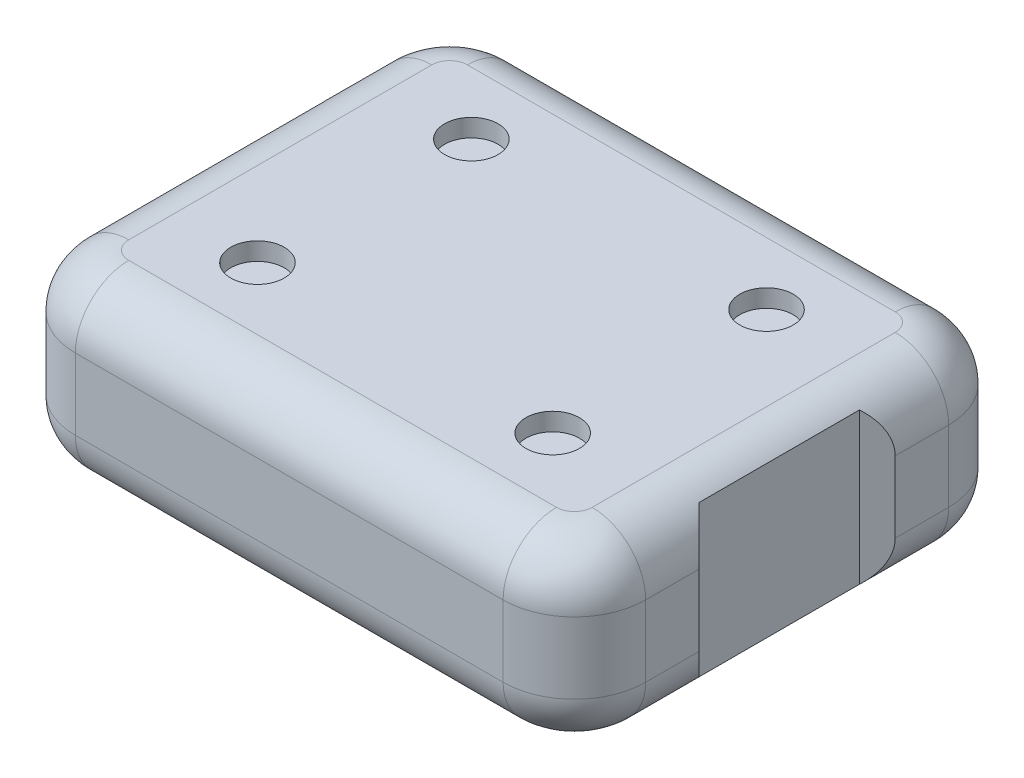
ISO-10303-21;
HEADER;
FILE_DESCRIPTION(('STEP AP214'),'2;1');
FILE_NAME('part.step','',(''),(''),'','','');
FILE_SCHEMA(('AUTOMOTIVE_DESIGN { 1 0 10303 214 1 1 1 1 }'));
ENDSEC;
DATA;
#1=APPLICATION_CONTEXT('core data for automotive mechanical design processes');
#2=APPLICATION_PROTOCOL_DEFINITION('international standard','automotive_design',2000,#1);
#3=PRODUCT_CONTEXT('',#1,'mechanical');
#4=PRODUCT('Part','Part','',(#3));
#5=PRODUCT_RELATED_PRODUCT_CATEGORY('part','',(#4));
#6=PRODUCT_DEFINITION_FORMATION('','',#4);
#7=PRODUCT_DEFINITION_CONTEXT('part definition',#1,'design');
#8=PRODUCT_DEFINITION('design','',#6,#7);
#9=PRODUCT_DEFINITION_SHAPE('','',#8);
#10=(LENGTH_UNIT() NAMED_UNIT(*) SI_UNIT(.MILLI.,.METRE.));
#11=(NAMED_UNIT(*) PLANE_ANGLE_UNIT() SI_UNIT($,.RADIAN.));
#12=(NAMED_UNIT(*) SI_UNIT($,.STERADIAN.) SOLID_ANGLE_UNIT());
#13=UNCERTAINTY_MEASURE_WITH_UNIT(LENGTH_MEASURE(1.E-05),#10,'distance_accuracy_value','');
#14=(GEOMETRIC_REPRESENTATION_CONTEXT(3) GLOBAL_UNCERTAINTY_ASSIGNED_CONTEXT((#13)) GLOBAL_UNIT_ASSIGNED_CONTEXT((#10,
#11,#12)) REPRESENTATION_CONTEXT('',''));
#15=CARTESIAN_POINT('',(0.,0.,0.));
#16=DIRECTION('',(0.,0.,1.));
#17=DIRECTION('',(1.,0.,0.));
#18=AXIS2_PLACEMENT_3D('',#15,#16,#17);
#19=CARTESIAN_POINT('',(1.2,1.,-0.85));
#20=DIRECTION('',(0.,-1.,0.));
#21=DIRECTION('',(0.,0.,-1.));
#22=AXIS2_PLACEMENT_3D('',#19,#20,#21);
#23=CYLINDRICAL_SURFACE('',#22,0.4);
#24=DIRECTION('',(0.,-1.,0.));
#25=VECTOR('',#24,1.);
#26=CARTESIAN_POINT('',(1.6,1.,-0.849999999999997));
#27=LINE('',#26,#25);
#28=CARTESIAN_POINT('',(1.6,0.7,-0.849999999999997));
#29=VERTEX_POINT('',#28);
#30=CARTESIAN_POINT('',(1.6,0.3,-0.849999999999997));
#31=VERTEX_POINT('',#30);
#32=EDGE_CURVE('E195',#29,#31,#27,.T.);
#33=ORIENTED_EDGE('',*,*,#32,.T.);
#34=CARTESIAN_POINT('',(1.2,0.3,-0.85));
#35=DIRECTION('',(0.,-1.,0.));
#36=DIRECTION('',(0.,0.,-1.));
#37=AXIS2_PLACEMENT_3D('',#34,#35,#36);
#38=CIRCLE('',#37,0.4);
#39=CARTESIAN_POINT('',(1.2,0.3,-1.25));
#40=VERTEX_POINT('',#39);
#41=EDGE_CURVE('E202',#31,#40,#38,.F.);
#42=ORIENTED_EDGE('',*,*,#41,.T.);
#43=DIRECTION('',(0.,-1.,0.));
#44=VECTOR('',#43,1.);
#45=CARTESIAN_POINT('',(1.2,1.,-1.25));
#46=LINE('',#45,#44);
#47=CARTESIAN_POINT('',(1.2,0.7,-1.25));
#48=VERTEX_POINT('',#47);
#49=EDGE_CURVE('E197',#48,#40,#46,.T.);
#50=ORIENTED_EDGE('',*,*,#49,.F.);
#51=CARTESIAN_POINT('',(1.2,0.7,-0.85));
#52=DIRECTION('',(0.,-1.,0.));
#53=DIRECTION('',(0.,0.,-1.));
#54=AXIS2_PLACEMENT_3D('',#51,#52,#53);
#55=CIRCLE('',#54,0.4);
#56=EDGE_CURVE('E193',#48,#29,#55,.T.);
#57=ORIENTED_EDGE('',*,*,#56,.T.);
#58=EDGE_LOOP('',(#33,#42,#50,#57));
#59=FACE_BOUND('',#58,.T.);
#60=ADVANCED_FACE('F31',(#59),#23,.T.);
#61=CARTESIAN_POINT('',(-1.2,1.,-1.25));
#62=DIRECTION('',(0.,0.,1.));
#63=DIRECTION('',(1.,0.,0.));
#64=AXIS2_PLACEMENT_3D('',#61,#62,#63);
#65=PLANE('',#64);
#66=DIRECTION('',(0.,-1.,0.));
#67=VECTOR('',#66,1.);
#68=CARTESIAN_POINT('',(-1.2,1.,-1.25));
#69=LINE('',#68,#67);
#70=CARTESIAN_POINT('',(-1.2,0.7,-1.25));
#71=VERTEX_POINT('',#70);
#72=CARTESIAN_POINT('',(-1.2,0.3,-1.25));
#73=VERTEX_POINT('',#72);
#74=EDGE_CURVE('E359',#71,#73,#69,.T.);
#75=ORIENTED_EDGE('',*,*,#74,.F.);
#76=DIRECTION('',(-1.,0.,0.));
#77=VECTOR('',#76,1.);
#78=CARTESIAN_POINT('',(-1.2,0.7,-1.25));
#79=LINE('',#78,#77);
#80=EDGE_CURVE('E11',#71,#48,#79,.F.);
#81=ORIENTED_EDGE('',*,*,#80,.T.);
#82=ORIENTED_EDGE('',*,*,#49,.T.);
#83=DIRECTION('',(-1.,0.,0.));
#84=VECTOR('',#83,1.);
#85=CARTESIAN_POINT('',(-1.2,0.3,-1.25));
#86=LINE('',#85,#84);
#87=EDGE_CURVE('E40',#40,#73,#86,.T.);
#88=ORIENTED_EDGE('',*,*,#87,.T.);
#89=EDGE_LOOP('',(#75,#81,#82,#88));
#90=FACE_BOUND('',#89,.T.);
#91=ADVANCED_FACE('F500',(#90),#65,.F.);
#92=CARTESIAN_POINT('',(-1.2,1.,-0.85));
#93=DIRECTION('',(0.,-1.,0.));
#94=DIRECTION('',(0.,0.,-1.));
#95=AXIS2_PLACEMENT_3D('',#92,#93,#94);
#96=CYLINDRICAL_SURFACE('',#95,0.4);
#97=ORIENTED_EDGE('',*,*,#74,.T.);
#98=CARTESIAN_POINT('',(-1.2,0.3,-0.85));
#99=DIRECTION('',(0.,-1.,0.));
#100=DIRECTION('',(0.,0.,-1.));
#101=AXIS2_PLACEMENT_3D('',#98,#99,#100);
#102=CIRCLE('',#101,0.4);
#103=CARTESIAN_POINT('',(-1.6,0.3,-0.849999999999997));
#104=VERTEX_POINT('',#103);
#105=EDGE_CURVE('E316',#73,#104,#102,.F.);
#106=ORIENTED_EDGE('',*,*,#105,.T.);
#107=DIRECTION('',(0.,-1.,0.));
#108=VECTOR('',#107,1.);
#109=CARTESIAN_POINT('',(-1.6,1.,-0.849999999999997));
#110=LINE('',#109,#108);
#111=CARTESIAN_POINT('',(-1.6,0.7,-0.849999999999997));
#112=VERTEX_POINT('',#111);
#113=EDGE_CURVE('E362',#112,#104,#110,.T.);
#114=ORIENTED_EDGE('',*,*,#113,.F.);
#115=CARTESIAN_POINT('',(-1.2,0.7,-0.85));
#116=DIRECTION('',(0.,-1.,0.));
#117=DIRECTION('',(0.,0.,-1.));
#118=AXIS2_PLACEMENT_3D('',#115,#116,#117);
#119=CIRCLE('',#118,0.4);
#120=EDGE_CURVE('E318',#112,#71,#119,.T.);
#121=ORIENTED_EDGE('',*,*,#120,.T.);
#122=EDGE_LOOP('',(#97,#106,#114,#121));
#123=FACE_BOUND('',#122,.T.);
#124=ADVANCED_FACE('F505',(#123),#96,.T.);
#125=CARTESIAN_POINT('',(-1.6,1.,-0.55));
#126=DIRECTION('',(1.,0.,0.));
#127=DIRECTION('',(0.,0.,-1.));
#128=AXIS2_PLACEMENT_3D('',#125,#126,#127);
#129=PLANE('',#128);
#130=ORIENTED_EDGE('',*,*,#113,.T.);
#131=DIRECTION('',(0.,0.,1.));
#132=VECTOR('',#131,1.);
#133=CARTESIAN_POINT('',(-1.6,0.3,-0.55));
#134=LINE('',#133,#132);
#135=CARTESIAN_POINT('',(-1.6,0.3,-0.55));
#136=VERTEX_POINT('',#135);
#137=EDGE_CURVE('E329',#104,#136,#134,.T.);
#138=ORIENTED_EDGE('',*,*,#137,.T.);
#139=DIRECTION('',(0.,-1.,0.));
#140=VECTOR('',#139,1.);
#141=CARTESIAN_POINT('',(-1.6,1.,-0.55));
#142=LINE('',#141,#140);
#143=CARTESIAN_POINT('',(-1.6,0.7,-0.55));
#144=VERTEX_POINT('',#143);
#145=EDGE_CURVE('E365',#144,#136,#142,.T.);
#146=ORIENTED_EDGE('',*,*,#145,.F.);
#147=DIRECTION('',(0.,0.,1.));
#148=VECTOR('',#147,1.);
#149=CARTESIAN_POINT('',(-1.6,0.7,-0.55));
#150=LINE('',#149,#148);
#151=EDGE_CURVE('E331',#144,#112,#150,.F.);
#152=ORIENTED_EDGE('',*,*,#151,.T.);
#153=EDGE_LOOP('',(#130,#138,#146,#152));
#154=FACE_BOUND('',#153,.T.);
#155=ADVANCED_FACE('F702',(#154),#129,.F.);
#156=CARTESIAN_POINT('',(-1.5,1.,-0.45));
#157=DIRECTION('',(0.707106781186547,0.,-0.707106781186548));
#158=DIRECTION('',(-0.707106781186548,0.,-0.707106781186547));
#159=AXIS2_PLACEMENT_3D('',#156,#157,#158);
#160=PLANE('',#159);
#161=ORIENTED_EDGE('',*,*,#145,.T.);
#162=CARTESIAN_POINT('',(-1.3,0.3,-0.250000000000001));
#163=DIRECTION('',(0.707106781186547,0.,-0.707106781186548));
#164=DIRECTION('',(-0.707106781186548,0.,-0.707106781186547));
#165=AXIS2_PLACEMENT_3D('',#162,#163,#164);
#166=ELLIPSE('',#165,0.424264068711928,0.3);
#167=CARTESIAN_POINT('',(-1.5,0.0763932022500207,-0.45));
#168=VERTEX_POINT('',#167);
#169=EDGE_CURVE('E324',#136,#168,#166,.F.);
#170=ORIENTED_EDGE('',*,*,#169,.T.);
#171=DIRECTION('',(0.,-1.,0.));
#172=VECTOR('',#171,1.);
#173=CARTESIAN_POINT('',(-1.5,1.,-0.45));
#174=LINE('',#173,#172);
#175=CARTESIAN_POINT('',(-1.5,0.923606797749979,-0.45));
#176=VERTEX_POINT('',#175);
#177=EDGE_CURVE('E368',#176,#168,#174,.T.);
#178=ORIENTED_EDGE('',*,*,#177,.F.);
#179=CARTESIAN_POINT('',(-1.3,0.7,-0.25));
#180=DIRECTION('',(0.707106781186547,0.,-0.707106781186548));
#181=DIRECTION('',(0.707106781186548,0.,0.707106781186547));
#182=AXIS2_PLACEMENT_3D('',#179,#180,#181);
#183=ELLIPSE('',#182,0.424264068711928,0.3);
#184=EDGE_CURVE('E327',#176,#144,#183,.F.);
#185=ORIENTED_EDGE('',*,*,#184,.T.);
#186=EDGE_LOOP('',(#161,#170,#178,#185));
#187=FACE_BOUND('',#186,.T.);
#188=ADVANCED_FACE('F692',(#187),#160,.F.);
#189=CARTESIAN_POINT('',(-1.5,1.,-0.45));
#190=DIRECTION('',(1.,0.,0.));
#191=DIRECTION('',(0.,0.,-1.));
#192=AXIS2_PLACEMENT_3D('',#189,#190,#191);
#193=PLANE('',#192);
#194=ORIENTED_EDGE('',*,*,#177,.T.);
#195=DIRECTION('',(0.,0.,-1.));
#196=VECTOR('',#195,1.);
#197=CARTESIAN_POINT('',(-1.5,0.0763932022500209,-0.45));
#198=LINE('',#197,#196);
#199=CARTESIAN_POINT('',(-1.5,0.0763932022500209,0.45));
#200=VERTEX_POINT('',#199);
#201=EDGE_CURVE('E320',#168,#200,#198,.F.);
#202=ORIENTED_EDGE('',*,*,#201,.T.);
#203=DIRECTION('',(0.,-1.,0.));
#204=VECTOR('',#203,1.);
#205=CARTESIAN_POINT('',(-1.5,1.,0.45));
#206=LINE('',#205,#204);
#207=CARTESIAN_POINT('',(-1.5,0.92360679774998,0.45));
#208=VERTEX_POINT('',#207);
#209=EDGE_CURVE('E371',#208,#200,#206,.T.);
#210=ORIENTED_EDGE('',*,*,#209,.F.);
#211=DIRECTION('',(0.,0.,1.));
#212=VECTOR('',#211,1.);
#213=CARTESIAN_POINT('',(-1.5,0.92360679774998,0.45));
#214=LINE('',#213,#212);
#215=EDGE_CURVE('E322',#208,#176,#214,.F.);
#216=ORIENTED_EDGE('',*,*,#215,.T.);
#217=EDGE_LOOP('',(#194,#202,#210,#216));
#218=FACE_BOUND('',#217,.T.);
#219=ADVANCED_FACE('F682',(#218),#193,.F.);
#220=CARTESIAN_POINT('',(-1.5,1.,0.45));
#221=DIRECTION('',(0.707106781186547,0.,0.707106781186548));
#222=DIRECTION('',(0.707106781186548,0.,-0.707106781186547));
#223=AXIS2_PLACEMENT_3D('',#220,#221,#222);
#224=PLANE('',#223);
#225=ORIENTED_EDGE('',*,*,#209,.T.);
#226=CARTESIAN_POINT('',(-1.3,0.3,0.250000000000001));
#227=DIRECTION('',(0.707106781186547,0.,0.707106781186548));
#228=DIRECTION('',(0.707106781186548,0.,-0.707106781186547));
#229=AXIS2_PLACEMENT_3D('',#226,#227,#228);
#230=ELLIPSE('',#229,0.424264068711928,0.3);
#231=CARTESIAN_POINT('',(-1.6,0.3,0.55));
#232=VERTEX_POINT('',#231);
#233=EDGE_CURVE('E306',#200,#232,#230,.F.);
#234=ORIENTED_EDGE('',*,*,#233,.T.);
#235=DIRECTION('',(0.,-1.,0.));
#236=VECTOR('',#235,1.);
#237=CARTESIAN_POINT('',(-1.6,1.,0.55));
#238=LINE('',#237,#236);
#239=CARTESIAN_POINT('',(-1.6,0.7,0.55));
#240=VERTEX_POINT('',#239);
#241=EDGE_CURVE('E374',#240,#232,#238,.T.);
#242=ORIENTED_EDGE('',*,*,#241,.F.);
#243=CARTESIAN_POINT('',(-1.3,0.7,0.250000000000001));
#244=DIRECTION('',(0.707106781186547,0.,0.707106781186548));
#245=DIRECTION('',(-0.707106781186548,0.,0.707106781186547));
#246=AXIS2_PLACEMENT_3D('',#243,#244,#245);
#247=ELLIPSE('',#246,0.424264068711928,0.3);
#248=EDGE_CURVE('E308',#240,#208,#247,.F.);
#249=ORIENTED_EDGE('',*,*,#248,.T.);
#250=EDGE_LOOP('',(#225,#234,#242,#249));
#251=FACE_BOUND('',#250,.T.);
#252=ADVANCED_FACE('F672',(#251),#224,.F.);
#253=CARTESIAN_POINT('',(-1.6,1.,0.849999999999997));
#254=DIRECTION('',(1.,0.,0.));
#255=DIRECTION('',(0.,0.,-1.));
#256=AXIS2_PLACEMENT_3D('',#253,#254,#255);
#257=PLANE('',#256);
#258=ORIENTED_EDGE('',*,*,#241,.T.);
#259=DIRECTION('',(0.,0.,1.));
#260=VECTOR('',#259,1.);
#261=CARTESIAN_POINT('',(-1.6,0.3,0.849999999999997));
#262=LINE('',#261,#260);
#263=CARTESIAN_POINT('',(-1.6,0.3,0.849999999999997));
#264=VERTEX_POINT('',#263);
#265=EDGE_CURVE('E311',#232,#264,#262,.T.);
#266=ORIENTED_EDGE('',*,*,#265,.T.);
#267=DIRECTION('',(0.,-1.,0.));
#268=VECTOR('',#267,1.);
#269=CARTESIAN_POINT('',(-1.6,1.,0.849999999999997));
#270=LINE('',#269,#268);
#271=CARTESIAN_POINT('',(-1.6,0.7,0.849999999999997));
#272=VERTEX_POINT('',#271);
#273=EDGE_CURVE('E377',#272,#264,#270,.T.);
#274=ORIENTED_EDGE('',*,*,#273,.F.);
#275=DIRECTION('',(0.,0.,1.));
#276=VECTOR('',#275,1.);
#277=CARTESIAN_POINT('',(-1.6,0.7,0.849999999999997));
#278=LINE('',#277,#276);
#279=EDGE_CURVE('E313',#272,#240,#278,.F.);
#280=ORIENTED_EDGE('',*,*,#279,.T.);
#281=EDGE_LOOP('',(#258,#266,#274,#280));
#282=FACE_BOUND('',#281,.T.);
#283=ADVANCED_FACE('F662',(#282),#257,.F.);
#284=CARTESIAN_POINT('',(-1.2,1.,0.85));
#285=DIRECTION('',(0.,-1.,0.));
#286=DIRECTION('',(0.,0.,-1.));
#287=AXIS2_PLACEMENT_3D('',#284,#285,#286);
#288=CYLINDRICAL_SURFACE('',#287,0.4);
#289=ORIENTED_EDGE('',*,*,#273,.T.);
#290=CARTESIAN_POINT('',(-1.2,0.3,0.85));
#291=DIRECTION('',(0.,-1.,0.));
#292=DIRECTION('',(0.,0.,-1.));
#293=AXIS2_PLACEMENT_3D('',#290,#291,#292);
#294=CIRCLE('',#293,0.4);
#295=CARTESIAN_POINT('',(-1.2,0.3,1.25));
#296=VERTEX_POINT('',#295);
#297=EDGE_CURVE('E302',#264,#296,#294,.F.);
#298=ORIENTED_EDGE('',*,*,#297,.T.);
#299=DIRECTION('',(0.,-1.,0.));
#300=VECTOR('',#299,1.);
#301=CARTESIAN_POINT('',(-1.2,1.,1.25));
#302=LINE('',#301,#300);
#303=CARTESIAN_POINT('',(-1.2,0.7,1.25));
#304=VERTEX_POINT('',#303);
#305=EDGE_CURVE('E380',#304,#296,#302,.T.);
#306=ORIENTED_EDGE('',*,*,#305,.F.);
#307=CARTESIAN_POINT('',(-1.2,0.7,0.85));
#308=DIRECTION('',(0.,-1.,0.));
#309=DIRECTION('',(0.,0.,-1.));
#310=AXIS2_PLACEMENT_3D('',#307,#308,#309);
#311=CIRCLE('',#310,0.4);
#312=EDGE_CURVE('E304',#304,#272,#311,.T.);
#313=ORIENTED_EDGE('',*,*,#312,.T.);
#314=EDGE_LOOP('',(#289,#298,#306,#313));
#315=FACE_BOUND('',#314,.T.);
#316=ADVANCED_FACE('F652',(#315),#288,.T.);
#317=CARTESIAN_POINT('',(-1.2,1.,1.25));
#318=DIRECTION('',(0.,0.,-1.));
#319=DIRECTION('',(-1.,0.,0.));
#320=AXIS2_PLACEMENT_3D('',#317,#318,#319);
#321=PLANE('',#320);
#322=DIRECTION('',(0.,-1.,0.));
#323=VECTOR('',#322,1.);
#324=CARTESIAN_POINT('',(1.2,1.,1.25));
#325=LINE('',#324,#323);
#326=CARTESIAN_POINT('',(1.2,0.7,1.25));
#327=VERTEX_POINT('',#326);
#328=CARTESIAN_POINT('',(1.2,0.3,1.25));
#329=VERTEX_POINT('',#328);
#330=EDGE_CURVE('E383',#327,#329,#325,.T.);
#331=ORIENTED_EDGE('',*,*,#330,.F.);
#332=DIRECTION('',(1.,0.,0.));
#333=VECTOR('',#332,1.);
#334=CARTESIAN_POINT('',(-1.2,0.7,1.25));
#335=LINE('',#334,#333);
#336=EDGE_CURVE('E273',#327,#304,#335,.F.);
#337=ORIENTED_EDGE('',*,*,#336,.T.);
#338=ORIENTED_EDGE('',*,*,#305,.T.);
#339=DIRECTION('',(1.,0.,0.));
#340=VECTOR('',#339,1.);
#341=CARTESIAN_POINT('',(1.2,0.3,1.25));
#342=LINE('',#341,#340);
#343=EDGE_CURVE('E275',#296,#329,#342,.T.);
#344=ORIENTED_EDGE('',*,*,#343,.T.);
#345=EDGE_LOOP('',(#331,#337,#338,#344));
#346=FACE_BOUND('',#345,.T.);
#347=ADVANCED_FACE('F643',(#346),#321,.F.);
#348=CARTESIAN_POINT('',(1.2,1.,0.85));
#349=DIRECTION('',(0.,-1.,0.));
#350=DIRECTION('',(0.,0.,-1.));
#351=AXIS2_PLACEMENT_3D('',#348,#349,#350);
#352=CYLINDRICAL_SURFACE('',#351,0.4);
#353=ORIENTED_EDGE('',*,*,#330,.T.);
#354=CARTESIAN_POINT('',(1.2,0.3,0.85));
#355=DIRECTION('',(0.,-1.,0.));
#356=DIRECTION('',(0.,0.,-1.));
#357=AXIS2_PLACEMENT_3D('',#354,#355,#356);
#358=CIRCLE('',#357,0.4);
#359=CARTESIAN_POINT('',(1.6,0.3,0.849999999999997));
#360=VERTEX_POINT('',#359);
#361=EDGE_CURVE('E290',#329,#360,#358,.F.);
#362=ORIENTED_EDGE('',*,*,#361,.T.);
#363=DIRECTION('',(0.,-1.,0.));
#364=VECTOR('',#363,1.);
#365=CARTESIAN_POINT('',(1.6,1.,0.849999999999997));
#366=LINE('',#365,#364);
#367=CARTESIAN_POINT('',(1.6,0.7,0.849999999999997));
#368=VERTEX_POINT('',#367);
#369=EDGE_CURVE('E386',#368,#360,#366,.T.);
#370=ORIENTED_EDGE('',*,*,#369,.F.);
#371=CARTESIAN_POINT('',(1.2,0.7,0.85));
#372=DIRECTION('',(0.,-1.,0.));
#373=DIRECTION('',(0.,0.,-1.));
#374=AXIS2_PLACEMENT_3D('',#371,#372,#373);
#375=CIRCLE('',#374,0.4);
#376=EDGE_CURVE('E292',#368,#327,#375,.T.);
#377=ORIENTED_EDGE('',*,*,#376,.T.);
#378=EDGE_LOOP('',(#353,#362,#370,#377));
#379=FACE_BOUND('',#378,.T.);
#380=ADVANCED_FACE('F470',(#379),#352,.T.);
#381=CARTESIAN_POINT('',(1.6,1.,0.849999999999997));
#382=DIRECTION('',(-1.,0.,0.));
#383=DIRECTION('',(0.,0.,1.));
#384=AXIS2_PLACEMENT_3D('',#381,#382,#383);
#385=PLANE('',#384);
#386=ORIENTED_EDGE('',*,*,#369,.T.);
#387=DIRECTION('',(0.,0.,-1.));
#388=VECTOR('',#387,1.);
#389=CARTESIAN_POINT('',(1.6,0.3,0.55));
#390=LINE('',#389,#388);
#391=CARTESIAN_POINT('',(1.6,0.3,0.55));
#392=VERTEX_POINT('',#391);
#393=EDGE_CURVE('E298',#360,#392,#390,.T.);
#394=ORIENTED_EDGE('',*,*,#393,.T.);
#395=DIRECTION('',(0.,-1.,0.));
#396=VECTOR('',#395,1.);
#397=CARTESIAN_POINT('',(1.6,1.,0.55));
#398=LINE('',#397,#396);
#399=CARTESIAN_POINT('',(1.6,0.7,0.55));
#400=VERTEX_POINT('',#399);
#401=EDGE_CURVE('E389',#400,#392,#398,.T.);
#402=ORIENTED_EDGE('',*,*,#401,.F.);
#403=DIRECTION('',(0.,0.,-1.));
#404=VECTOR('',#403,1.);
#405=CARTESIAN_POINT('',(1.6,0.7,0.849999999999997));
#406=LINE('',#405,#404);
#407=EDGE_CURVE('E300',#400,#368,#406,.F.);
#408=ORIENTED_EDGE('',*,*,#407,.T.);
#409=EDGE_LOOP('',(#386,#394,#402,#408));
#410=FACE_BOUND('',#409,.T.);
#411=ADVANCED_FACE('F467',(#410),#385,.F.);
#412=CARTESIAN_POINT('',(1.5,1.,0.45));
#413=DIRECTION('',(-0.707106781186544,0.,0.707106781186551));
#414=DIRECTION('',(0.707106781186551,0.,0.707106781186544));
#415=AXIS2_PLACEMENT_3D('',#412,#413,#414);
#416=PLANE('',#415);
#417=ORIENTED_EDGE('',*,*,#401,.T.);
#418=CARTESIAN_POINT('',(1.3,0.3,0.250000000000003));
#419=DIRECTION('',(-0.707106781186544,0.,0.707106781186551));
#420=DIRECTION('',(0.707106781186551,0.,0.707106781186544));
#421=AXIS2_PLACEMENT_3D('',#418,#419,#420);
#422=ELLIPSE('',#421,0.424264068711926,0.3);
#423=CARTESIAN_POINT('',(1.5,0.0763932022500202,0.45));
#424=VERTEX_POINT('',#423);
#425=EDGE_CURVE('E294',#392,#424,#422,.F.);
#426=ORIENTED_EDGE('',*,*,#425,.T.);
#427=DIRECTION('',(0.,-1.,0.));
#428=VECTOR('',#427,1.);
#429=CARTESIAN_POINT('',(1.5,1.,0.45));
#430=LINE('',#429,#428);
#431=CARTESIAN_POINT('',(1.5,0.92360679774998,0.45));
#432=VERTEX_POINT('',#431);
#433=EDGE_CURVE('E392',#432,#424,#430,.T.);
#434=ORIENTED_EDGE('',*,*,#433,.F.);
#435=CARTESIAN_POINT('',(1.3,0.7,0.250000000000003));
#436=DIRECTION('',(-0.707106781186544,0.,0.707106781186551));
#437=DIRECTION('',(-0.707106781186551,0.,-0.707106781186544));
#438=AXIS2_PLACEMENT_3D('',#435,#436,#437);
#439=ELLIPSE('',#438,0.424264068711926,0.3);
#440=EDGE_CURVE('E296',#432,#400,#439,.F.);
#441=ORIENTED_EDGE('',*,*,#440,.T.);
#442=EDGE_LOOP('',(#417,#426,#434,#441));
#443=FACE_BOUND('',#442,.T.);
#444=ADVANCED_FACE('F483',(#443),#416,.F.);
#445=CARTESIAN_POINT('',(1.5,1.,-0.45));
#446=DIRECTION('',(-1.,0.,0.));
#447=DIRECTION('',(0.,0.,1.));
#448=AXIS2_PLACEMENT_3D('',#445,#446,#447);
#449=PLANE('',#448);
#450=DIRECTION('',(0.,0.,1.));
#451=VECTOR('',#450,1.);
#452=CARTESIAN_POINT('',(1.5,0.0763932022500203,0.45));
#453=LINE('',#452,#451);
#454=CARTESIAN_POINT('',(1.5,0.0763932022500203,-0.45));
#455=VERTEX_POINT('',#454);
#456=EDGE_CURVE('E336',#424,#455,#453,.F.);
#457=ORIENTED_EDGE('',*,*,#456,.T.);
#458=DIRECTION('',(0.,-1.,0.));
#459=VECTOR('',#458,1.);
#460=CARTESIAN_POINT('',(1.5,1.,-0.45));
#461=LINE('',#460,#459);
#462=CARTESIAN_POINT('',(1.5,0.92360679774998,-0.45));
#463=VERTEX_POINT('',#462);
#464=EDGE_CURVE('E395',#463,#455,#461,.T.);
#465=ORIENTED_EDGE('',*,*,#464,.F.);
#466=DIRECTION('',(0.,0.,-1.));
#467=VECTOR('',#466,1.);
#468=CARTESIAN_POINT('',(1.5,0.92360679774998,-0.45));
#469=LINE('',#468,#467);
#470=EDGE_CURVE('E338',#463,#432,#469,.F.);
#471=ORIENTED_EDGE('',*,*,#470,.T.);
#472=ORIENTED_EDGE('',*,*,#433,.T.);
#473=EDGE_LOOP('',(#457,#465,#471,#472));
#474=FACE_BOUND('',#473,.T.);
#475=ADVANCED_FACE('F486',(#474),#449,.F.);
#476=CARTESIAN_POINT('',(1.5,1.,-0.45));
#477=DIRECTION('',(-0.707106781186544,0.,-0.707106781186551));
#478=DIRECTION('',(-0.707106781186551,0.,0.707106781186544));
#479=AXIS2_PLACEMENT_3D('',#476,#477,#478);
#480=PLANE('',#479);
#481=ORIENTED_EDGE('',*,*,#464,.T.);
#482=CARTESIAN_POINT('',(1.3,0.3,-0.250000000000002));
#483=DIRECTION('',(-0.707106781186544,0.,-0.707106781186551));
#484=DIRECTION('',(-0.707106781186551,0.,0.707106781186544));
#485=AXIS2_PLACEMENT_3D('',#482,#483,#484);
#486=ELLIPSE('',#485,0.424264068711927,0.3);
#487=CARTESIAN_POINT('',(1.6,0.3,-0.55));
#488=VERTEX_POINT('',#487);
#489=EDGE_CURVE('E203',#455,#488,#486,.F.);
#490=ORIENTED_EDGE('',*,*,#489,.T.);
#491=DIRECTION('',(0.,-1.,0.));
#492=VECTOR('',#491,1.);
#493=CARTESIAN_POINT('',(1.6,1.,-0.55));
#494=LINE('',#493,#492);
#495=CARTESIAN_POINT('',(1.6,0.7,-0.55));
#496=VERTEX_POINT('',#495);
#497=EDGE_CURVE('E214',#496,#488,#494,.T.);
#498=ORIENTED_EDGE('',*,*,#497,.F.);
#499=CARTESIAN_POINT('',(1.3,0.7,-0.250000000000002));
#500=DIRECTION('',(-0.707106781186544,0.,-0.707106781186551));
#501=DIRECTION('',(0.707106781186551,0.,-0.707106781186544));
#502=AXIS2_PLACEMENT_3D('',#499,#500,#501);
#503=ELLIPSE('',#502,0.424264068711927,0.3);
#504=EDGE_CURVE('E222',#496,#463,#503,.F.);
#505=ORIENTED_EDGE('',*,*,#504,.T.);
#506=EDGE_LOOP('',(#481,#490,#498,#505));
#507=FACE_BOUND('',#506,.T.);
#508=ADVANCED_FACE('F490',(#507),#480,.F.);
#509=CARTESIAN_POINT('',(1.6,1.,-0.55));
#510=DIRECTION('',(-1.,0.,0.));
#511=DIRECTION('',(0.,0.,1.));
#512=AXIS2_PLACEMENT_3D('',#509,#510,#511);
#513=PLANE('',#512);
#514=ORIENTED_EDGE('',*,*,#497,.T.);
#515=DIRECTION('',(0.,0.,-1.));
#516=VECTOR('',#515,1.);
#517=CARTESIAN_POINT('',(1.6,0.3,-0.849999999999997));
#518=LINE('',#517,#516);
#519=EDGE_CURVE('E213',#488,#31,#518,.T.);
#520=ORIENTED_EDGE('',*,*,#519,.T.);
#521=ORIENTED_EDGE('',*,*,#32,.F.);
#522=DIRECTION('',(0.,0.,-1.));
#523=VECTOR('',#522,1.);
#524=CARTESIAN_POINT('',(1.6,0.7,-0.55));
#525=LINE('',#524,#523);
#526=EDGE_CURVE('E210',#29,#496,#525,.F.);
#527=ORIENTED_EDGE('',*,*,#526,.T.);
#528=EDGE_LOOP('',(#514,#520,#521,#527));
#529=FACE_BOUND('',#528,.T.);
#530=ADVANCED_FACE('F209',(#529),#513,.F.);
#531=CARTESIAN_POINT('',(1.2,1.,-0.85));
#532=DIRECTION('',(0.,-1.,0.));
#533=DIRECTION('',(0.,0.,-1.));
#534=AXIS2_PLACEMENT_3D('',#531,#532,#533);
#535=PLANE('',#534);
#536=CARTESIAN_POINT('',(0.828084679575029,1.,0.6));
#537=DIRECTION('',(0.,1.,0.));
#538=DIRECTION('',(0.,0.,1.));
#539=AXIS2_PLACEMENT_3D('',#536,#537,#538);
#540=CIRCLE('',#539,0.15);
#541=CARTESIAN_POINT('',(0.828084679575029,1.,0.75));
#542=VERTEX_POINT('',#541);
#543=EDGE_CURVE('E417',#542,#542,#540,.T.);
#544=ORIENTED_EDGE('',*,*,#543,.F.);
#545=EDGE_LOOP('',(#544));
#546=FACE_BOUND('',#545,.T.);
#547=CARTESIAN_POINT('',(-0.828084679575029,1.,0.6));
#548=DIRECTION('',(0.,1.,0.));
#549=DIRECTION('',(0.,0.,1.));
#550=AXIS2_PLACEMENT_3D('',#547,#548,#549);
#551=CIRCLE('',#550,0.15);
#552=CARTESIAN_POINT('',(-0.828084679575029,1.,0.75));
#553=VERTEX_POINT('',#552);
#554=EDGE_CURVE('E411',#553,#553,#551,.T.);
#555=ORIENTED_EDGE('',*,*,#554,.F.);
#556=EDGE_LOOP('',(#555));
#557=FACE_BOUND('',#556,.T.);
#558=CARTESIAN_POINT('',(-0.828084679575029,1.,-0.6));
#559=DIRECTION('',(0.,1.,0.));
#560=DIRECTION('',(0.,0.,1.));
#561=AXIS2_PLACEMENT_3D('',#558,#559,#560);
#562=CIRCLE('',#561,0.15);
#563=CARTESIAN_POINT('',(-0.828084679575029,1.,-0.45));
#564=VERTEX_POINT('',#563);
#565=EDGE_CURVE('E405',#564,#564,#562,.T.);
#566=ORIENTED_EDGE('',*,*,#565,.F.);
#567=EDGE_LOOP('',(#566));
#568=FACE_BOUND('',#567,.T.);
#569=CARTESIAN_POINT('',(0.828084679575029,1.,-0.6));
#570=DIRECTION('',(0.,1.,0.));
#571=DIRECTION('',(0.,0.,1.));
#572=AXIS2_PLACEMENT_3D('',#569,#570,#571);
#573=CIRCLE('',#572,0.15);
#574=CARTESIAN_POINT('',(0.828084679575029,1.,-0.45));
#575=VERTEX_POINT('',#574);
#576=EDGE_CURVE('E399',#575,#575,#573,.T.);
#577=ORIENTED_EDGE('',*,*,#576,.F.);
#578=EDGE_LOOP('',(#577));
#579=FACE_BOUND('',#578,.T.);
#580=DIRECTION('',(0.,0.,1.));
#581=VECTOR('',#580,1.);
#582=CARTESIAN_POINT('',(-1.3,1.,-0.850000000000002));
#583=LINE('',#582,#581);
#584=CARTESIAN_POINT('',(-1.3,1.,-0.849999999999997));
#585=VERTEX_POINT('',#584);
#586=CARTESIAN_POINT('',(-1.3,1.,0.849999999999997));
#587=VERTEX_POINT('',#586);
#588=EDGE_CURVE('E281',#585,#587,#583,.T.);
#589=ORIENTED_EDGE('',*,*,#588,.T.);
#590=CARTESIAN_POINT('',(-1.2,1.,0.85));
#591=DIRECTION('',(0.,-1.,0.));
#592=DIRECTION('',(0.,0.,-1.));
#593=AXIS2_PLACEMENT_3D('',#590,#591,#592);
#594=CIRCLE('',#593,0.1);
#595=CARTESIAN_POINT('',(-1.2,1.,0.95));
#596=VERTEX_POINT('',#595);
#597=EDGE_CURVE('E48',#587,#596,#594,.F.);
#598=ORIENTED_EDGE('',*,*,#597,.T.);
#599=DIRECTION('',(1.,0.,0.));
#600=VECTOR('',#599,1.);
#601=CARTESIAN_POINT('',(1.2,1.,0.95));
#602=LINE('',#601,#600);
#603=CARTESIAN_POINT('',(1.2,1.,0.95));
#604=VERTEX_POINT('',#603);
#605=EDGE_CURVE('E52',#596,#604,#602,.T.);
#606=ORIENTED_EDGE('',*,*,#605,.T.);
#607=CARTESIAN_POINT('',(1.2,1.,0.85));
#608=DIRECTION('',(0.,-1.,0.));
#609=DIRECTION('',(0.,0.,-1.));
#610=AXIS2_PLACEMENT_3D('',#607,#608,#609);
#611=CIRCLE('',#610,0.1);
#612=CARTESIAN_POINT('',(1.3,1.,0.849999999999997));
#613=VERTEX_POINT('',#612);
#614=EDGE_CURVE('E279',#604,#613,#611,.F.);
#615=ORIENTED_EDGE('',*,*,#614,.T.);
#616=DIRECTION('',(0.,0.,-1.));
#617=VECTOR('',#616,1.);
#618=CARTESIAN_POINT('',(1.3,1.,-0.85));
#619=LINE('',#618,#617);
#620=CARTESIAN_POINT('',(1.3,1.,-0.849999999999999));
#621=VERTEX_POINT('',#620);
#622=EDGE_CURVE('E288',#613,#621,#619,.T.);
#623=ORIENTED_EDGE('',*,*,#622,.T.);
#624=CARTESIAN_POINT('',(1.2,1.,-0.85));
#625=DIRECTION('',(0.,-1.,0.));
#626=DIRECTION('',(0.,0.,-1.));
#627=AXIS2_PLACEMENT_3D('',#624,#625,#626);
#628=CIRCLE('',#627,0.1);
#629=CARTESIAN_POINT('',(1.2,1.,-0.95));
#630=VERTEX_POINT('',#629);
#631=EDGE_CURVE('E225',#621,#630,#628,.F.);
#632=ORIENTED_EDGE('',*,*,#631,.T.);
#633=DIRECTION('',(-1.,0.,0.));
#634=VECTOR('',#633,1.);
#635=CARTESIAN_POINT('',(1.2,1.,-0.95));
#636=LINE('',#635,#634);
#637=CARTESIAN_POINT('',(-1.2,1.,-0.95));
#638=VERTEX_POINT('',#637);
#639=EDGE_CURVE('E285',#630,#638,#636,.T.);
#640=ORIENTED_EDGE('',*,*,#639,.T.);
#641=CARTESIAN_POINT('',(-1.2,1.,-0.85));
#642=DIRECTION('',(0.,-1.,0.));
#643=DIRECTION('',(0.,0.,-1.));
#644=AXIS2_PLACEMENT_3D('',#641,#642,#643);
#645=CIRCLE('',#644,0.1);
#646=EDGE_CURVE('E283',#638,#585,#645,.F.);
#647=ORIENTED_EDGE('',*,*,#646,.T.);
#648=EDGE_LOOP('',(#589,#598,#606,#615,#623,#632,#640,#647));
#649=FACE_BOUND('',#648,.T.);
#650=ADVANCED_FACE('F432',(#546,#557,#568,#579,#649),#535,.F.);
#651=CARTESIAN_POINT('',(1.2,0.,-0.85));
#652=DIRECTION('',(0.,-1.,0.));
#653=DIRECTION('',(0.,0.,-1.));
#654=AXIS2_PLACEMENT_3D('',#651,#652,#653);
#655=PLANE('',#654);
#656=CARTESIAN_POINT('',(-1.2,0.,-0.85));
#657=DIRECTION('',(0.,-1.,0.));
#658=DIRECTION('',(0.,0.,-1.));
#659=AXIS2_PLACEMENT_3D('',#656,#657,#658);
#660=CIRCLE('',#659,0.1);
#661=CARTESIAN_POINT('',(-1.3,0.,-0.849999999999997));
#662=VERTEX_POINT('',#661);
#663=CARTESIAN_POINT('',(-1.2,0.,-0.95));
#664=VERTEX_POINT('',#663);
#665=EDGE_CURVE('E345',#662,#664,#660,.T.);
#666=ORIENTED_EDGE('',*,*,#665,.T.);
#667=DIRECTION('',(-1.,0.,0.));
#668=VECTOR('',#667,1.);
#669=CARTESIAN_POINT('',(1.2,0.,-0.95));
#670=LINE('',#669,#668);
#671=CARTESIAN_POINT('',(1.2,0.,-0.95));
#672=VERTEX_POINT('',#671);
#673=EDGE_CURVE('E340',#664,#672,#670,.F.);
#674=ORIENTED_EDGE('',*,*,#673,.T.);
#675=CARTESIAN_POINT('',(1.2,0.,-0.85));
#676=DIRECTION('',(0.,-1.,0.));
#677=DIRECTION('',(0.,0.,-1.));
#678=AXIS2_PLACEMENT_3D('',#675,#676,#677);
#679=CIRCLE('',#678,0.1);
#680=CARTESIAN_POINT('',(1.3,0.,-0.849999999999997));
#681=VERTEX_POINT('',#680);
#682=EDGE_CURVE('E342',#672,#681,#679,.T.);
#683=ORIENTED_EDGE('',*,*,#682,.T.);
#684=DIRECTION('',(0.,0.,-1.));
#685=VECTOR('',#684,1.);
#686=CARTESIAN_POINT('',(1.3,0.,0.849999999999997));
#687=LINE('',#686,#685);
#688=CARTESIAN_POINT('',(1.3,0.,0.849999999999997));
#689=VERTEX_POINT('',#688);
#690=EDGE_CURVE('E351',#681,#689,#687,.F.);
#691=ORIENTED_EDGE('',*,*,#690,.T.);
#692=CARTESIAN_POINT('',(1.2,0.,0.85));
#693=DIRECTION('',(0.,-1.,0.));
#694=DIRECTION('',(0.,0.,-1.));
#695=AXIS2_PLACEMENT_3D('',#692,#693,#694);
#696=CIRCLE('',#695,0.1);
#697=CARTESIAN_POINT('',(1.2,0.,0.95));
#698=VERTEX_POINT('',#697);
#699=EDGE_CURVE('E353',#689,#698,#696,.T.);
#700=ORIENTED_EDGE('',*,*,#699,.T.);
#701=DIRECTION('',(1.,0.,0.));
#702=VECTOR('',#701,1.);
#703=CARTESIAN_POINT('',(-1.2,0.,0.95));
#704=LINE('',#703,#702);
#705=CARTESIAN_POINT('',(-1.2,0.,0.95));
#706=VERTEX_POINT('',#705);
#707=EDGE_CURVE('E355',#698,#706,#704,.F.);
#708=ORIENTED_EDGE('',*,*,#707,.T.);
#709=CARTESIAN_POINT('',(-1.2,0.,0.85));
#710=DIRECTION('',(0.,-1.,0.));
#711=DIRECTION('',(0.,0.,-1.));
#712=AXIS2_PLACEMENT_3D('',#709,#710,#711);
#713=CIRCLE('',#712,0.1);
#714=CARTESIAN_POINT('',(-1.3,0.,0.849999999999997));
#715=VERTEX_POINT('',#714);
#716=EDGE_CURVE('E349',#706,#715,#713,.T.);
#717=ORIENTED_EDGE('',*,*,#716,.T.);
#718=DIRECTION('',(0.,0.,1.));
#719=VECTOR('',#718,1.);
#720=CARTESIAN_POINT('',(-1.3,0.,0.55));
#721=LINE('',#720,#719);
#722=EDGE_CURVE('E347',#715,#662,#721,.F.);
#723=ORIENTED_EDGE('',*,*,#722,.T.);
#724=EDGE_LOOP('',(#666,#674,#683,#691,#700,#708,#717,#723));
#725=FACE_BOUND('',#724,.T.);
#726=ADVANCED_FACE('F435',(#725),#655,.T.);
#727=CARTESIAN_POINT('',(-1.3,0.3,0.849999999999997));
#728=DIRECTION('',(0.,0.,-1.));
#729=DIRECTION('',(-1.,0.,0.));
#730=AXIS2_PLACEMENT_3D('',#727,#728,#729);
#731=CYLINDRICAL_SURFACE('',#730,0.3);
#732=ORIENTED_EDGE('',*,*,#201,.F.);
#733=ORIENTED_EDGE('',*,*,#169,.F.);
#734=ORIENTED_EDGE('',*,*,#137,.F.);
#735=CARTESIAN_POINT('',(-1.3,0.3,-0.849999999999997));
#736=DIRECTION('',(0.,0.,-1.));
#737=DIRECTION('',(-1.,0.,0.));
#738=AXIS2_PLACEMENT_3D('',#735,#736,#737);
#739=CIRCLE('',#738,0.3);
#740=EDGE_CURVE('E258',#662,#104,#739,.T.);
#741=ORIENTED_EDGE('',*,*,#740,.F.);
#742=ORIENTED_EDGE('',*,*,#722,.F.);
#743=CARTESIAN_POINT('',(-1.3,0.3,0.849999999999997));
#744=DIRECTION('',(0.,0.,1.));
#745=DIRECTION('',(1.,0.,0.));
#746=AXIS2_PLACEMENT_3D('',#743,#744,#745);
#747=CIRCLE('',#746,0.3);
#748=EDGE_CURVE('E215',#264,#715,#747,.T.);
#749=ORIENTED_EDGE('',*,*,#748,.F.);
#750=ORIENTED_EDGE('',*,*,#265,.F.);
#751=ORIENTED_EDGE('',*,*,#233,.F.);
#752=EDGE_LOOP('',(#732,#733,#734,#741,#742,#749,#750,#751));
#753=FACE_BOUND('',#752,.T.);
#754=ADVANCED_FACE('F533',(#753),#731,.T.);
#755=CARTESIAN_POINT('',(-1.2,0.3,0.85));
#756=DIRECTION('',(0.,-1.,0.));
#757=DIRECTION('',(0.,0.,-1.));
#758=AXIS2_PLACEMENT_3D('',#755,#756,#757);
#759=DEGENERATE_TOROIDAL_SURFACE('',#758,0.1,0.3,.T.);
#760=ORIENTED_EDGE('',*,*,#748,.T.);
#761=ORIENTED_EDGE('',*,*,#716,.F.);
#762=CARTESIAN_POINT('',(-1.2,0.3,0.95));
#763=DIRECTION('',(1.,0.,0.));
#764=DIRECTION('',(0.,0.,-1.));
#765=AXIS2_PLACEMENT_3D('',#762,#763,#764);
#766=CIRCLE('',#765,0.3);
#767=EDGE_CURVE('E255',#296,#706,#766,.T.);
#768=ORIENTED_EDGE('',*,*,#767,.F.);
#769=ORIENTED_EDGE('',*,*,#297,.F.);
#770=EDGE_LOOP('',(#760,#761,#768,#769));
#771=FACE_BOUND('',#770,.T.);
#772=ADVANCED_FACE('F529',(#771),#759,.T.);
#773=CARTESIAN_POINT('',(-1.2,0.3,0.95));
#774=DIRECTION('',(-1.,0.,0.));
#775=DIRECTION('',(0.,0.,1.));
#776=AXIS2_PLACEMENT_3D('',#773,#774,#775);
#777=CYLINDRICAL_SURFACE('',#776,0.3);
#778=ORIENTED_EDGE('',*,*,#767,.T.);
#779=ORIENTED_EDGE('',*,*,#707,.F.);
#780=CARTESIAN_POINT('',(1.2,0.3,0.95));
#781=DIRECTION('',(1.,0.,0.));
#782=DIRECTION('',(0.,1.,0.));
#783=AXIS2_PLACEMENT_3D('',#780,#781,#782);
#784=CIRCLE('',#783,0.3);
#785=EDGE_CURVE('E261',#329,#698,#784,.T.);
#786=ORIENTED_EDGE('',*,*,#785,.F.);
#787=ORIENTED_EDGE('',*,*,#343,.F.);
#788=EDGE_LOOP('',(#778,#779,#786,#787));
#789=FACE_BOUND('',#788,.T.);
#790=ADVANCED_FACE('F525',(#789),#777,.T.);
#791=CARTESIAN_POINT('',(-1.2,0.3,-0.85));
#792=DIRECTION('',(0.,-1.,0.));
#793=DIRECTION('',(0.,0.,-1.));
#794=AXIS2_PLACEMENT_3D('',#791,#792,#793);
#795=DEGENERATE_TOROIDAL_SURFACE('',#794,0.1,0.3,.T.);
#796=ORIENTED_EDGE('',*,*,#740,.T.);
#797=ORIENTED_EDGE('',*,*,#105,.F.);
#798=CARTESIAN_POINT('',(-1.2,0.3,-0.95));
#799=DIRECTION('',(1.,0.,0.));
#800=DIRECTION('',(0.,0.,-1.));
#801=AXIS2_PLACEMENT_3D('',#798,#799,#800);
#802=CIRCLE('',#801,0.3);
#803=EDGE_CURVE('E264',#664,#73,#802,.T.);
#804=ORIENTED_EDGE('',*,*,#803,.F.);
#805=ORIENTED_EDGE('',*,*,#665,.F.);
#806=EDGE_LOOP('',(#796,#797,#804,#805));
#807=FACE_BOUND('',#806,.T.);
#808=ADVANCED_FACE('F522',(#807),#795,.T.);
#809=CARTESIAN_POINT('',(1.2,0.3,0.85));
#810=DIRECTION('',(0.,-1.,0.));
#811=DIRECTION('',(0.,0.,-1.));
#812=AXIS2_PLACEMENT_3D('',#809,#810,#811);
#813=DEGENERATE_TOROIDAL_SURFACE('',#812,0.1,0.3,.T.);
#814=ORIENTED_EDGE('',*,*,#785,.T.);
#815=ORIENTED_EDGE('',*,*,#699,.F.);
#816=CARTESIAN_POINT('',(1.3,0.3,0.849999999999999));
#817=DIRECTION('',(0.,0.,-1.));
#818=DIRECTION('',(-1.,0.,0.));
#819=AXIS2_PLACEMENT_3D('',#816,#817,#818);
#820=CIRCLE('',#819,0.3);
#821=EDGE_CURVE('E267',#360,#689,#820,.T.);
#822=ORIENTED_EDGE('',*,*,#821,.F.);
#823=ORIENTED_EDGE('',*,*,#361,.F.);
#824=EDGE_LOOP('',(#814,#815,#822,#823));
#825=FACE_BOUND('',#824,.T.);
#826=ADVANCED_FACE('F475',(#825),#813,.T.);
#827=CARTESIAN_POINT('',(-1.2,0.3,-0.95));
#828=DIRECTION('',(1.,0.,0.));
#829=DIRECTION('',(0.,0.,-1.));
#830=AXIS2_PLACEMENT_3D('',#827,#828,#829);
#831=CYLINDRICAL_SURFACE('',#830,0.3);
#832=ORIENTED_EDGE('',*,*,#803,.T.);
#833=ORIENTED_EDGE('',*,*,#87,.F.);
#834=CARTESIAN_POINT('',(1.2,0.3,-0.95));
#835=DIRECTION('',(1.,0.,0.));
#836=DIRECTION('',(0.,0.,-1.));
#837=AXIS2_PLACEMENT_3D('',#834,#835,#836);
#838=CIRCLE('',#837,0.3);
#839=EDGE_CURVE('E228',#672,#40,#838,.T.);
#840=ORIENTED_EDGE('',*,*,#839,.F.);
#841=ORIENTED_EDGE('',*,*,#673,.F.);
#842=EDGE_LOOP('',(#832,#833,#840,#841));
#843=FACE_BOUND('',#842,.T.);
#844=ADVANCED_FACE('F516',(#843),#831,.T.);
#845=CARTESIAN_POINT('',(1.3,0.3,0.849999999999997));
#846=DIRECTION('',(0.,0.,1.));
#847=DIRECTION('',(1.,0.,0.));
#848=AXIS2_PLACEMENT_3D('',#845,#846,#847);
#849=CYLINDRICAL_SURFACE('',#848,0.3);
#850=ORIENTED_EDGE('',*,*,#821,.T.);
#851=ORIENTED_EDGE('',*,*,#690,.F.);
#852=CARTESIAN_POINT('',(1.3,0.3,-0.849999999999997));
#853=DIRECTION('',(0.,0.,1.));
#854=DIRECTION('',(1.,0.,0.));
#855=AXIS2_PLACEMENT_3D('',#852,#853,#854);
#856=CIRCLE('',#855,0.3);
#857=EDGE_CURVE('E226',#681,#31,#856,.T.);
#858=ORIENTED_EDGE('',*,*,#857,.T.);
#859=ORIENTED_EDGE('',*,*,#519,.F.);
#860=ORIENTED_EDGE('',*,*,#489,.F.);
#861=ORIENTED_EDGE('',*,*,#456,.F.);
#862=ORIENTED_EDGE('',*,*,#425,.F.);
#863=ORIENTED_EDGE('',*,*,#393,.F.);
#864=EDGE_LOOP('',(#850,#851,#858,#859,#860,#861,#862,#863));
#865=FACE_BOUND('',#864,.T.);
#866=ADVANCED_FACE('F480',(#865),#849,.T.);
#867=CARTESIAN_POINT('',(1.2,0.3,-0.85));
#868=DIRECTION('',(0.,-1.,0.));
#869=DIRECTION('',(0.,0.,-1.));
#870=AXIS2_PLACEMENT_3D('',#867,#868,#869);
#871=DEGENERATE_TOROIDAL_SURFACE('',#870,0.1,0.3,.T.);
#872=ORIENTED_EDGE('',*,*,#839,.T.);
#873=ORIENTED_EDGE('',*,*,#41,.F.);
#874=ORIENTED_EDGE('',*,*,#857,.F.);
#875=ORIENTED_EDGE('',*,*,#682,.F.);
#876=EDGE_LOOP('',(#872,#873,#874,#875));
#877=FACE_BOUND('',#876,.T.);
#878=ADVANCED_FACE('F510',(#877),#871,.T.);
#879=CARTESIAN_POINT('',(1.3,0.7,-0.85));
#880=DIRECTION('',(0.,0.,-1.));
#881=DIRECTION('',(-1.,0.,0.));
#882=AXIS2_PLACEMENT_3D('',#879,#880,#881);
#883=CYLINDRICAL_SURFACE('',#882,0.3);
#884=ORIENTED_EDGE('',*,*,#504,.F.);
#885=ORIENTED_EDGE('',*,*,#526,.F.);
#886=CARTESIAN_POINT('',(1.3,0.7,-0.849999999999999));
#887=DIRECTION('',(0.,0.,-1.));
#888=DIRECTION('',(-1.,0.,0.));
#889=AXIS2_PLACEMENT_3D('',#886,#887,#888);
#890=CIRCLE('',#889,0.3);
#891=EDGE_CURVE('E35',#621,#29,#890,.T.);
#892=ORIENTED_EDGE('',*,*,#891,.F.);
#893=ORIENTED_EDGE('',*,*,#622,.F.);
#894=CARTESIAN_POINT('',(1.3,0.7,0.849999999999997));
#895=DIRECTION('',(0.,0.,1.));
#896=DIRECTION('',(1.,0.,0.));
#897=AXIS2_PLACEMENT_3D('',#894,#895,#896);
#898=CIRCLE('',#897,0.3);
#899=EDGE_CURVE('E230',#368,#613,#898,.T.);
#900=ORIENTED_EDGE('',*,*,#899,.F.);
#901=ORIENTED_EDGE('',*,*,#407,.F.);
#902=ORIENTED_EDGE('',*,*,#440,.F.);
#903=ORIENTED_EDGE('',*,*,#470,.F.);
#904=EDGE_LOOP('',(#884,#885,#892,#893,#900,#901,#902,#903));
#905=FACE_BOUND('',#904,.T.);
#906=ADVANCED_FACE('F33',(#905),#883,.T.);
#907=CARTESIAN_POINT('',(1.2,0.7,-0.85));
#908=DIRECTION('',(0.,-1.,0.));
#909=DIRECTION('',(0.,0.,-1.));
#910=AXIS2_PLACEMENT_3D('',#907,#908,#909);
#911=DEGENERATE_TOROIDAL_SURFACE('',#910,0.1,0.3,.T.);
#912=ORIENTED_EDGE('',*,*,#891,.T.);
#913=ORIENTED_EDGE('',*,*,#56,.F.);
#914=CARTESIAN_POINT('',(1.2,0.7,-0.95));
#915=DIRECTION('',(-1.,0.,0.));
#916=DIRECTION('',(0.,0.,1.));
#917=AXIS2_PLACEMENT_3D('',#914,#915,#916);
#918=CIRCLE('',#917,0.3);
#919=EDGE_CURVE('E227',#630,#48,#918,.T.);
#920=ORIENTED_EDGE('',*,*,#919,.F.);
#921=ORIENTED_EDGE('',*,*,#631,.F.);
#922=EDGE_LOOP('',(#912,#913,#920,#921));
#923=FACE_BOUND('',#922,.T.);
#924=ADVANCED_FACE('F224',(#923),#911,.T.);
#925=CARTESIAN_POINT('',(1.2,0.7,-0.95));
#926=DIRECTION('',(-1.,0.,0.));
#927=DIRECTION('',(0.,0.,1.));
#928=AXIS2_PLACEMENT_3D('',#925,#926,#927);
#929=CYLINDRICAL_SURFACE('',#928,0.3);
#930=ORIENTED_EDGE('',*,*,#919,.T.);
#931=ORIENTED_EDGE('',*,*,#80,.F.);
#932=CARTESIAN_POINT('',(-1.2,0.7,-0.95));
#933=DIRECTION('',(-1.,0.,0.));
#934=DIRECTION('',(0.,0.,1.));
#935=AXIS2_PLACEMENT_3D('',#932,#933,#934);
#936=CIRCLE('',#935,0.3);
#937=EDGE_CURVE('E235',#638,#71,#936,.T.);
#938=ORIENTED_EDGE('',*,*,#937,.F.);
#939=ORIENTED_EDGE('',*,*,#639,.F.);
#940=EDGE_LOOP('',(#930,#931,#938,#939));
#941=FACE_BOUND('',#940,.T.);
#942=ADVANCED_FACE('F551',(#941),#929,.T.);
#943=CARTESIAN_POINT('',(1.2,0.7,0.85));
#944=DIRECTION('',(0.,-1.,0.));
#945=DIRECTION('',(0.,0.,-1.));
#946=AXIS2_PLACEMENT_3D('',#943,#944,#945);
#947=DEGENERATE_TOROIDAL_SURFACE('',#946,0.1,0.3,.T.);
#948=ORIENTED_EDGE('',*,*,#899,.T.);
#949=ORIENTED_EDGE('',*,*,#614,.F.);
#950=CARTESIAN_POINT('',(1.2,0.7,0.95));
#951=DIRECTION('',(-1.,0.,0.));
#952=DIRECTION('',(0.,-1.,0.));
#953=AXIS2_PLACEMENT_3D('',#950,#951,#952);
#954=CIRCLE('',#953,0.3);
#955=EDGE_CURVE('E240',#327,#604,#954,.T.);
#956=ORIENTED_EDGE('',*,*,#955,.F.);
#957=ORIENTED_EDGE('',*,*,#376,.F.);
#958=EDGE_LOOP('',(#948,#949,#956,#957));
#959=FACE_BOUND('',#958,.T.);
#960=ADVANCED_FACE('F460',(#959),#947,.T.);
#961=CARTESIAN_POINT('',(-1.2,0.7,-0.85));
#962=DIRECTION('',(0.,-1.,0.));
#963=DIRECTION('',(0.,0.,-1.));
#964=AXIS2_PLACEMENT_3D('',#961,#962,#963);
#965=DEGENERATE_TOROIDAL_SURFACE('',#964,0.1,0.3,.T.);
#966=ORIENTED_EDGE('',*,*,#937,.T.);
#967=ORIENTED_EDGE('',*,*,#120,.F.);
#968=CARTESIAN_POINT('',(-1.3,0.7,-0.849999999999997));
#969=DIRECTION('',(0.,0.,1.));
#970=DIRECTION('',(1.,0.,0.));
#971=AXIS2_PLACEMENT_3D('',#968,#969,#970);
#972=CIRCLE('',#971,0.3);
#973=EDGE_CURVE('E243',#585,#112,#972,.T.);
#974=ORIENTED_EDGE('',*,*,#973,.F.);
#975=ORIENTED_EDGE('',*,*,#646,.F.);
#976=EDGE_LOOP('',(#966,#967,#974,#975));
#977=FACE_BOUND('',#976,.T.);
#978=ADVANCED_FACE('F545',(#977),#965,.T.);
#979=CARTESIAN_POINT('',(1.2,0.7,0.95));
#980=DIRECTION('',(1.,0.,0.));
#981=DIRECTION('',(0.,0.,-1.));
#982=AXIS2_PLACEMENT_3D('',#979,#980,#981);
#983=CYLINDRICAL_SURFACE('',#982,0.3);
#984=ORIENTED_EDGE('',*,*,#955,.T.);
#985=ORIENTED_EDGE('',*,*,#605,.F.);
#986=CARTESIAN_POINT('',(-1.2,0.7,0.95));
#987=DIRECTION('',(-1.,0.,0.));
#988=DIRECTION('',(0.,-1.,0.));
#989=AXIS2_PLACEMENT_3D('',#986,#987,#988);
#990=CIRCLE('',#989,0.3);
#991=EDGE_CURVE('E246',#304,#596,#990,.T.);
#992=ORIENTED_EDGE('',*,*,#991,.F.);
#993=ORIENTED_EDGE('',*,*,#336,.F.);
#994=EDGE_LOOP('',(#984,#985,#992,#993));
#995=FACE_BOUND('',#994,.T.);
#996=ADVANCED_FACE('F456',(#995),#983,.T.);
#997=CARTESIAN_POINT('',(-1.3,0.7,-0.850000000000002));
#998=DIRECTION('',(0.,0.,1.));
#999=DIRECTION('',(1.,0.,0.));
#1000=AXIS2_PLACEMENT_3D('',#997,#998,#999);
#1001=CYLINDRICAL_SURFACE('',#1000,0.3);
#1002=ORIENTED_EDGE('',*,*,#184,.F.);
#1003=ORIENTED_EDGE('',*,*,#215,.F.);
#1004=ORIENTED_EDGE('',*,*,#248,.F.);
#1005=ORIENTED_EDGE('',*,*,#279,.F.);
#1006=CARTESIAN_POINT('',(-1.3,0.7,0.849999999999999));
#1007=DIRECTION('',(0.,0.,-1.));
#1008=DIRECTION('',(-1.,0.,0.));
#1009=AXIS2_PLACEMENT_3D('',#1006,#1007,#1008);
#1010=CIRCLE('',#1009,0.3);
#1011=EDGE_CURVE('E249',#272,#587,#1010,.T.);
#1012=ORIENTED_EDGE('',*,*,#1011,.T.);
#1013=ORIENTED_EDGE('',*,*,#588,.F.);
#1014=ORIENTED_EDGE('',*,*,#973,.T.);
#1015=ORIENTED_EDGE('',*,*,#151,.F.);
#1016=EDGE_LOOP('',(#1002,#1003,#1004,#1005,#1012,#1013,#1014,#1015));
#1017=FACE_BOUND('',#1016,.T.);
#1018=ADVANCED_FACE('F449',(#1017),#1001,.T.);
#1019=CARTESIAN_POINT('',(-1.2,0.7,0.85));
#1020=DIRECTION('',(0.,-1.,0.));
#1021=DIRECTION('',(0.,0.,-1.));
#1022=AXIS2_PLACEMENT_3D('',#1019,#1020,#1021);
#1023=DEGENERATE_TOROIDAL_SURFACE('',#1022,0.1,0.3,.T.);
#1024=ORIENTED_EDGE('',*,*,#991,.T.);
#1025=ORIENTED_EDGE('',*,*,#597,.F.);
#1026=ORIENTED_EDGE('',*,*,#1011,.F.);
#1027=ORIENTED_EDGE('',*,*,#312,.F.);
#1028=EDGE_LOOP('',(#1024,#1025,#1026,#1027));
#1029=FACE_BOUND('',#1028,.T.);
#1030=ADVANCED_FACE('F452',(#1029),#1023,.T.);
#1031=CARTESIAN_POINT('',(0.828084679575029,0.9,-0.6));
#1032=DIRECTION('',(0.,1.,0.));
#1033=DIRECTION('',(0.,0.,1.));
#1034=AXIS2_PLACEMENT_3D('',#1031,#1032,#1033);
#1035=CYLINDRICAL_SURFACE('',#1034,0.15);
#1036=CARTESIAN_POINT('',(0.828084679575029,0.9,-0.6));
#1037=DIRECTION('',(0.,1.,0.));
#1038=DIRECTION('',(0.,0.,1.));
#1039=AXIS2_PLACEMENT_3D('',#1036,#1037,#1038);
#1040=CIRCLE('',#1039,0.15);
#1041=CARTESIAN_POINT('',(0.828084679575029,0.9,-0.45));
#1042=VERTEX_POINT('',#1041);
#1043=EDGE_CURVE('E252',#1042,#1042,#1040,.T.);
#1044=ORIENTED_EDGE('',*,*,#1043,.F.);
#1045=EDGE_LOOP('',(#1044));
#1046=FACE_BOUND('',#1045,.T.);
#1047=ORIENTED_EDGE('',*,*,#576,.T.);
#1048=EDGE_LOOP('',(#1047));
#1049=FACE_BOUND('',#1048,.T.);
#1050=ADVANCED_FACE('F540',(#1046,#1049),#1035,.F.);
#1051=CARTESIAN_POINT('',(0.828084679575029,0.9,-0.6));
#1052=DIRECTION('',(0.,1.,0.));
#1053=DIRECTION('',(0.,0.,1.));
#1054=AXIS2_PLACEMENT_3D('',#1051,#1052,#1053);
#1055=PLANE('',#1054);
#1056=ORIENTED_EDGE('',*,*,#1043,.T.);
#1057=EDGE_LOOP('',(#1056));
#1058=FACE_BOUND('',#1057,.T.);
#1059=ADVANCED_FACE('F826',(#1058),#1055,.T.);
#1060=CARTESIAN_POINT('',(-0.828084679575029,0.9,-0.6));
#1061=DIRECTION('',(0.,1.,0.));
#1062=DIRECTION('',(0.,0.,1.));
#1063=AXIS2_PLACEMENT_3D('',#1060,#1061,#1062);
#1064=CYLINDRICAL_SURFACE('',#1063,0.15);
#1065=CARTESIAN_POINT('',(-0.828084679575029,0.9,-0.6));
#1066=DIRECTION('',(0.,1.,0.));
#1067=DIRECTION('',(0.,0.,1.));
#1068=AXIS2_PLACEMENT_3D('',#1065,#1066,#1067);
#1069=CIRCLE('',#1068,0.15);
#1070=CARTESIAN_POINT('',(-0.828084679575029,0.9,-0.45));
#1071=VERTEX_POINT('',#1070);
#1072=EDGE_CURVE('E402',#1071,#1071,#1069,.T.);
#1073=ORIENTED_EDGE('',*,*,#1072,.F.);
#1074=EDGE_LOOP('',(#1073));
#1075=FACE_BOUND('',#1074,.T.);
#1076=ORIENTED_EDGE('',*,*,#565,.T.);
#1077=EDGE_LOOP('',(#1076));
#1078=FACE_BOUND('',#1077,.T.);
#1079=ADVANCED_FACE('F835',(#1075,#1078),#1064,.F.);
#1080=CARTESIAN_POINT('',(-0.828084679575029,0.9,-0.6));
#1081=DIRECTION('',(0.,1.,0.));
#1082=DIRECTION('',(0.,0.,1.));
#1083=AXIS2_PLACEMENT_3D('',#1080,#1081,#1082);
#1084=PLANE('',#1083);
#1085=ORIENTED_EDGE('',*,*,#1072,.T.);
#1086=EDGE_LOOP('',(#1085));
#1087=FACE_BOUND('',#1086,.T.);
#1088=ADVANCED_FACE('F844',(#1087),#1084,.T.);
#1089=CARTESIAN_POINT('',(-0.828084679575029,0.9,0.6));
#1090=DIRECTION('',(0.,1.,0.));
#1091=DIRECTION('',(0.,0.,1.));
#1092=AXIS2_PLACEMENT_3D('',#1089,#1090,#1091);
#1093=CYLINDRICAL_SURFACE('',#1092,0.15);
#1094=CARTESIAN_POINT('',(-0.828084679575029,0.9,0.6));
#1095=DIRECTION('',(0.,1.,0.));
#1096=DIRECTION('',(0.,0.,1.));
#1097=AXIS2_PLACEMENT_3D('',#1094,#1095,#1096);
#1098=CIRCLE('',#1097,0.15);
#1099=CARTESIAN_POINT('',(-0.828084679575029,0.9,0.75));
#1100=VERTEX_POINT('',#1099);
#1101=EDGE_CURVE('E408',#1100,#1100,#1098,.T.);
#1102=ORIENTED_EDGE('',*,*,#1101,.F.);
#1103=EDGE_LOOP('',(#1102));
#1104=FACE_BOUND('',#1103,.T.);
#1105=ORIENTED_EDGE('',*,*,#554,.T.);
#1106=EDGE_LOOP('',(#1105));
#1107=FACE_BOUND('',#1106,.T.);
#1108=ADVANCED_FACE('F853',(#1104,#1107),#1093,.F.);
#1109=CARTESIAN_POINT('',(-0.828084679575029,0.9,0.6));
#1110=DIRECTION('',(0.,1.,0.));
#1111=DIRECTION('',(0.,0.,1.));
#1112=AXIS2_PLACEMENT_3D('',#1109,#1110,#1111);
#1113=PLANE('',#1112);
#1114=ORIENTED_EDGE('',*,*,#1101,.T.);
#1115=EDGE_LOOP('',(#1114));
#1116=FACE_BOUND('',#1115,.T.);
#1117=ADVANCED_FACE('F428',(#1116),#1113,.T.);
#1118=CARTESIAN_POINT('',(0.828084679575029,0.9,0.6));
#1119=DIRECTION('',(0.,1.,0.));
#1120=DIRECTION('',(0.,0.,1.));
#1121=AXIS2_PLACEMENT_3D('',#1118,#1119,#1120);
#1122=CYLINDRICAL_SURFACE('',#1121,0.15);
#1123=CARTESIAN_POINT('',(0.828084679575029,0.9,0.6));
#1124=DIRECTION('',(0.,1.,0.));
#1125=DIRECTION('',(0.,0.,1.));
#1126=AXIS2_PLACEMENT_3D('',#1123,#1124,#1125);
#1127=CIRCLE('',#1126,0.15);
#1128=CARTESIAN_POINT('',(0.828084679575029,0.9,0.75));
#1129=VERTEX_POINT('',#1128);
#1130=EDGE_CURVE('E414',#1129,#1129,#1127,.T.);
#1131=ORIENTED_EDGE('',*,*,#1130,.F.);
#1132=EDGE_LOOP('',(#1131));
#1133=FACE_BOUND('',#1132,.T.);
#1134=ORIENTED_EDGE('',*,*,#543,.T.);
#1135=EDGE_LOOP('',(#1134));
#1136=FACE_BOUND('',#1135,.T.);
#1137=ADVANCED_FACE('F425',(#1133,#1136),#1122,.F.);
#1138=CARTESIAN_POINT('',(0.828084679575029,0.9,0.6));
#1139=DIRECTION('',(0.,1.,0.));
#1140=DIRECTION('',(0.,0.,1.));
#1141=AXIS2_PLACEMENT_3D('',#1138,#1139,#1140);
#1142=PLANE('',#1141);
#1143=ORIENTED_EDGE('',*,*,#1130,.T.);
#1144=EDGE_LOOP('',(#1143));
#1145=FACE_BOUND('',#1144,.T.);
#1146=ADVANCED_FACE('F423',(#1145),#1142,.T.);
#1147=CLOSED_SHELL('',(#60,#91,#124,#155,#188,#219,#252,#283,#316,#347,#380,#411,#444,#475,#508,
#530,#650,#726,#754,#772,#790,#808,#826,#844,#866,#878,#906,#924,#942,#960,#978,#996,#1018,
#1030,#1050,#1059,#1079,#1088,#1108,#1117,#1137,#1146));
#1148=MANIFOLD_SOLID_BREP('B2',#1147);
#1149=ADVANCED_BREP_SHAPE_REPRESENTATION('',(#18,#1148),#14);
#1150=SHAPE_DEFINITION_REPRESENTATION(#9,#1149);
ENDSEC;
END-ISO-10303-21;
